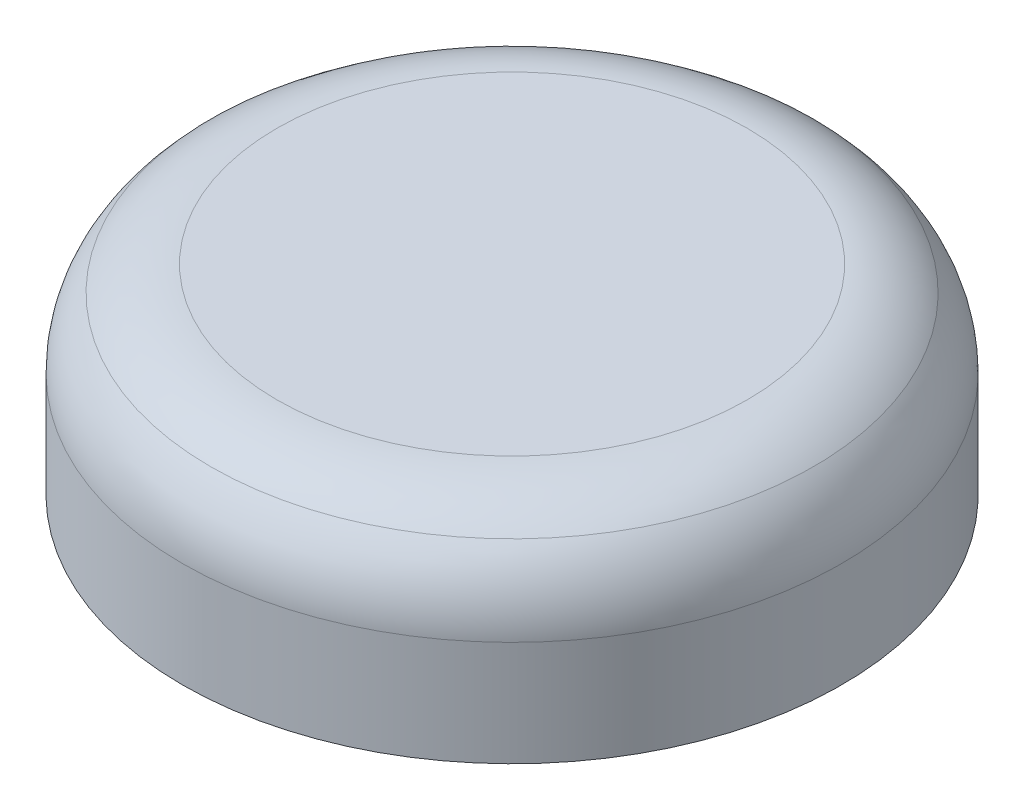
ISO-10303-21;
HEADER;
FILE_DESCRIPTION(('STEP AP214'),'2;1');
FILE_NAME('part.step','',(''),(''),'','','');
FILE_SCHEMA(('AUTOMOTIVE_DESIGN { 1 0 10303 214 1 1 1 1 }'));
ENDSEC;
DATA;
#1=APPLICATION_CONTEXT('core data for automotive mechanical design processes');
#2=APPLICATION_PROTOCOL_DEFINITION('international standard','automotive_design',2000,#1);
#3=PRODUCT_CONTEXT('',#1,'mechanical');
#4=PRODUCT('Part','Part','',(#3));
#5=PRODUCT_RELATED_PRODUCT_CATEGORY('part','',(#4));
#6=PRODUCT_DEFINITION_FORMATION('','',#4);
#7=PRODUCT_DEFINITION_CONTEXT('part definition',#1,'design');
#8=PRODUCT_DEFINITION('design','',#6,#7);
#9=PRODUCT_DEFINITION_SHAPE('','',#8);
#10=(LENGTH_UNIT() NAMED_UNIT(*) SI_UNIT(.MILLI.,.METRE.));
#11=(NAMED_UNIT(*) PLANE_ANGLE_UNIT() SI_UNIT($,.RADIAN.));
#12=(NAMED_UNIT(*) SI_UNIT($,.STERADIAN.) SOLID_ANGLE_UNIT());
#13=UNCERTAINTY_MEASURE_WITH_UNIT(LENGTH_MEASURE(1.E-05),#10,'distance_accuracy_value','');
#14=(GEOMETRIC_REPRESENTATION_CONTEXT(3) GLOBAL_UNCERTAINTY_ASSIGNED_CONTEXT((#13)) GLOBAL_UNIT_ASSIGNED_CONTEXT((#10,
#11,#12)) REPRESENTATION_CONTEXT('',''));
#15=CARTESIAN_POINT('',(0.,0.,0.));
#16=DIRECTION('',(0.,0.,1.));
#17=DIRECTION('',(1.,0.,0.));
#18=AXIS2_PLACEMENT_3D('',#15,#16,#17);
#19=CARTESIAN_POINT('',(0.,15.,0.));
#20=DIRECTION('',(0.,-1.,0.));
#21=DIRECTION('',(0.,0.,-1.));
#22=AXIS2_PLACEMENT_3D('',#19,#20,#21);
#23=CYLINDRICAL_SURFACE('',#22,30.);
#24=CARTESIAN_POINT('',(0.,15.,0.));
#25=DIRECTION('',(0.,-1.,0.));
#26=DIRECTION('',(0.,0.,-1.));
#27=AXIS2_PLACEMENT_3D('',#24,#25,#26);
#28=CIRCLE('',#27,30.);
#29=CARTESIAN_POINT('',(0.,15.,-30.));
#30=VERTEX_POINT('',#29);
#31=EDGE_CURVE('E53',#30,#30,#28,.T.);
#32=ORIENTED_EDGE('',*,*,#31,.F.);
#33=EDGE_LOOP('',(#32));
#34=FACE_BOUND('',#33,.T.);
#35=CARTESIAN_POINT('',(0.,0.,0.));
#36=DIRECTION('',(0.,1.,0.));
#37=DIRECTION('',(0.,0.,1.));
#38=AXIS2_PLACEMENT_3D('',#35,#36,#37);
#39=CIRCLE('',#38,30.);
#40=CARTESIAN_POINT('',(0.,0.,30.));
#41=VERTEX_POINT('',#40);
#42=EDGE_CURVE('E44',#41,#41,#39,.T.);
#43=ORIENTED_EDGE('',*,*,#42,.F.);
#44=EDGE_LOOP('',(#43));
#45=FACE_BOUND('',#44,.T.);
#46=ADVANCED_FACE('F33',(#34,#45),#23,.F.);
#47=CARTESIAN_POINT('',(0.,15.,0.));
#48=DIRECTION('',(0.,-1.,0.));
#49=DIRECTION('',(0.,0.,-1.));
#50=AXIS2_PLACEMENT_3D('',#47,#48,#49);
#51=CYLINDRICAL_SURFACE('',#50,33.);
#52=CARTESIAN_POINT('',(0.,10.5244027735491,0.));
#53=DIRECTION('',(0.,1.,0.));
#54=DIRECTION('',(0.,0.,1.));
#55=AXIS2_PLACEMENT_3D('',#52,#53,#54);
#56=CIRCLE('',#55,33.);
#57=CARTESIAN_POINT('',(0.,10.5244027735491,33.));
#58=VERTEX_POINT('',#57);
#59=EDGE_CURVE('E10',#58,#58,#56,.F.);
#60=ORIENTED_EDGE('',*,*,#59,.T.);
#61=EDGE_LOOP('',(#60));
#62=FACE_BOUND('',#61,.T.);
#63=CARTESIAN_POINT('',(0.,0.,0.));
#64=DIRECTION('',(0.,1.,0.));
#65=DIRECTION('',(0.,0.,1.));
#66=AXIS2_PLACEMENT_3D('',#63,#64,#65);
#67=CIRCLE('',#66,33.);
#68=CARTESIAN_POINT('',(0.,0.,33.));
#69=VERTEX_POINT('',#68);
#70=EDGE_CURVE('E40',#69,#69,#67,.T.);
#71=ORIENTED_EDGE('',*,*,#70,.T.);
#72=EDGE_LOOP('',(#71));
#73=FACE_BOUND('',#72,.T.);
#74=ADVANCED_FACE('F103',(#62,#73),#51,.T.);
#75=CARTESIAN_POINT('',(0.,0.,0.));
#76=DIRECTION('',(0.,1.,0.));
#77=DIRECTION('',(0.,0.,1.));
#78=AXIS2_PLACEMENT_3D('',#75,#76,#77);
#79=PLANE('',#78);
#80=ORIENTED_EDGE('',*,*,#42,.T.);
#81=EDGE_LOOP('',(#80));
#82=FACE_BOUND('',#81,.T.);
#83=ORIENTED_EDGE('',*,*,#70,.F.);
#84=EDGE_LOOP('',(#83));
#85=FACE_BOUND('',#84,.T.);
#86=ADVANCED_FACE('F106',(#82,#85),#79,.F.);
#87=CARTESIAN_POINT('',(0.,20.,0.));
#88=DIRECTION('',(0.,-1.,0.));
#89=DIRECTION('',(0.,0.,-1.));
#90=AXIS2_PLACEMENT_3D('',#87,#88,#89);
#91=PLANE('',#90);
#92=CARTESIAN_POINT('',(0.,20.,0.));
#93=DIRECTION('',(0.,-1.,0.));
#94=DIRECTION('',(0.,0.,-1.));
#95=AXIS2_PLACEMENT_3D('',#92,#93,#94);
#96=CIRCLE('',#95,23.5508881747693);
#97=CARTESIAN_POINT('',(0.,20.,-23.5508881747693));
#98=VERTEX_POINT('',#97);
#99=EDGE_CURVE('E59',#98,#98,#96,.T.);
#100=ORIENTED_EDGE('',*,*,#99,.F.);
#101=EDGE_LOOP('',(#100));
#102=FACE_BOUND('',#101,.T.);
#103=ADVANCED_FACE('F109',(#102),#91,.F.);
#104=CARTESIAN_POINT('',(0.,10.,0.));
#105=DIRECTION('',(0.,-1.,0.));
#106=DIRECTION('',(0.,0.,-1.));
#107=AXIS2_PLACEMENT_3D('',#104,#105,#106);
#108=TOROIDAL_SURFACE('',#107,23.5508881747693,10.);
#109=CARTESIAN_POINT('',(0.,17.5,0.));
#110=DIRECTION('',(0.,-1.,0.));
#111=DIRECTION('',(0.,0.,-1.));
#112=AXIS2_PLACEMENT_3D('',#109,#110,#111);
#113=CIRCLE('',#112,30.1652664524308);
#114=CARTESIAN_POINT('',(0.,17.5,-30.1652664524308));
#115=VERTEX_POINT('',#114);
#116=EDGE_CURVE('E56',#115,#115,#113,.T.);
#117=ORIENTED_EDGE('',*,*,#116,.F.);
#118=EDGE_LOOP('',(#117));
#119=FACE_BOUND('',#118,.T.);
#120=ORIENTED_EDGE('',*,*,#99,.T.);
#121=EDGE_LOOP('',(#120));
#122=FACE_BOUND('',#121,.T.);
#123=ADVANCED_FACE('F92',(#119,#122),#108,.T.);
#124=CARTESIAN_POINT('',(0.,7.50000000000001,0.));
#125=DIRECTION('',(0.,-1.,0.));
#126=DIRECTION('',(0.,0.,-1.));
#127=AXIS2_PLACEMENT_3D('',#124,#125,#126);
#128=TOROIDAL_SURFACE('',#127,23.227821859521,10.);
#129=CARTESIAN_POINT('',(0.,17.2384396336338,0.));
#130=DIRECTION('',(0.,-1.,0.));
#131=DIRECTION('',(0.,0.,-1.));
#132=AXIS2_PLACEMENT_3D('',#129,#130,#131);
#133=CIRCLE('',#132,25.5);
#134=CARTESIAN_POINT('',(0.,17.2384396336338,-25.5));
#135=VERTEX_POINT('',#134);
#136=EDGE_CURVE('E69',#135,#135,#133,.T.);
#137=ORIENTED_EDGE('',*,*,#136,.F.);
#138=EDGE_LOOP('',(#137));
#139=FACE_BOUND('',#138,.T.);
#140=CARTESIAN_POINT('',(0.,15.808760260363,0.));
#141=DIRECTION('',(0.,-1.,0.));
#142=DIRECTION('',(0.,0.,-1.));
#143=AXIS2_PLACEMENT_3D('',#140,#141,#142);
#144=CIRCLE('',#143,28.7923975788201);
#145=CARTESIAN_POINT('',(0.,15.808760260363,-28.7923975788201));
#146=VERTEX_POINT('',#145);
#147=EDGE_CURVE('E48',#146,#146,#144,.T.);
#148=ORIENTED_EDGE('',*,*,#147,.T.);
#149=EDGE_LOOP('',(#148));
#150=FACE_BOUND('',#149,.T.);
#151=ADVANCED_FACE('F88',(#139,#150),#128,.F.);
#152=CARTESIAN_POINT('',(0.,15.,0.));
#153=DIRECTION('',(0.,-1.,0.));
#154=DIRECTION('',(0.,0.,-1.));
#155=AXIS2_PLACEMENT_3D('',#152,#153,#154);
#156=CONICAL_SURFACE('',#155,30.,0.980680129844024);
#157=ORIENTED_EDGE('',*,*,#147,.F.);
#158=EDGE_LOOP('',(#157));
#159=FACE_BOUND('',#158,.T.);
#160=ORIENTED_EDGE('',*,*,#31,.T.);
#161=EDGE_LOOP('',(#160));
#162=FACE_BOUND('',#161,.T.);
#163=ADVANCED_FACE('F91',(#159,#162),#156,.F.);
#164=CARTESIAN_POINT('',(0.,7.50000000000001,0.));
#165=DIRECTION('',(0.,-1.,0.));
#166=DIRECTION('',(0.,0.,-1.));
#167=AXIS2_PLACEMENT_3D('',#164,#165,#166);
#168=TOROIDAL_SURFACE('',#167,23.227821859521,10.);
#169=CARTESIAN_POINT('',(0.,17.4770014296258,0.));
#170=DIRECTION('',(0.,-1.,0.));
#171=DIRECTION('',(0.,0.,-1.));
#172=AXIS2_PLACEMENT_3D('',#169,#170,#171);
#173=CIRCLE('',#172,22.55);
#174=CARTESIAN_POINT('',(0.,17.4770014296258,-22.55));
#175=VERTEX_POINT('',#174);
#176=EDGE_CURVE('E65',#175,#175,#173,.T.);
#177=ORIENTED_EDGE('',*,*,#176,.T.);
#178=EDGE_LOOP('',(#177));
#179=FACE_BOUND('',#178,.T.);
#180=CARTESIAN_POINT('',(0.,17.5,0.));
#181=DIRECTION('',(0.,-1.,0.));
#182=DIRECTION('',(0.,0.,-1.));
#183=AXIS2_PLACEMENT_3D('',#180,#181,#182);
#184=CIRCLE('',#183,23.227821859521);
#185=CARTESIAN_POINT('',(0.,17.5,-23.227821859521));
#186=VERTEX_POINT('',#185);
#187=EDGE_CURVE('E62',#186,#186,#184,.T.);
#188=ORIENTED_EDGE('',*,*,#187,.F.);
#189=EDGE_LOOP('',(#188));
#190=FACE_BOUND('',#189,.T.);
#191=ADVANCED_FACE('F84',(#179,#190),#168,.T.);
#192=CARTESIAN_POINT('',(0.,36.0624458405139,0.));
#193=DIRECTION('',(0.,-1.,0.));
#194=DIRECTION('',(0.,0.,-1.));
#195=AXIS2_PLACEMENT_3D('',#192,#193,#194);
#196=CYLINDRICAL_SURFACE('',#195,25.5);
#197=CARTESIAN_POINT('',(0.,0.,0.));
#198=DIRECTION('',(0.,-1.,0.));
#199=DIRECTION('',(0.,0.,-1.));
#200=AXIS2_PLACEMENT_3D('',#197,#198,#199);
#201=CIRCLE('',#200,25.5);
#202=CARTESIAN_POINT('',(0.,0.,-25.5));
#203=VERTEX_POINT('',#202);
#204=EDGE_CURVE('E68',#203,#203,#201,.T.);
#205=ORIENTED_EDGE('',*,*,#204,.F.);
#206=EDGE_LOOP('',(#205));
#207=FACE_BOUND('',#206,.T.);
#208=ORIENTED_EDGE('',*,*,#136,.T.);
#209=EDGE_LOOP('',(#208));
#210=FACE_BOUND('',#209,.T.);
#211=ADVANCED_FACE('F80',(#207,#210),#196,.T.);
#212=CARTESIAN_POINT('',(0.,36.0624458405139,0.));
#213=DIRECTION('',(0.,-1.,0.));
#214=DIRECTION('',(0.,0.,-1.));
#215=AXIS2_PLACEMENT_3D('',#212,#213,#214);
#216=CYLINDRICAL_SURFACE('',#215,22.55);
#217=CARTESIAN_POINT('',(0.,0.,0.));
#218=DIRECTION('',(0.,-1.,0.));
#219=DIRECTION('',(0.,0.,-1.));
#220=AXIS2_PLACEMENT_3D('',#217,#218,#219);
#221=CIRCLE('',#220,22.55);
#222=CARTESIAN_POINT('',(0.,0.,-22.55));
#223=VERTEX_POINT('',#222);
#224=EDGE_CURVE('E72',#223,#223,#221,.T.);
#225=ORIENTED_EDGE('',*,*,#224,.T.);
#226=EDGE_LOOP('',(#225));
#227=FACE_BOUND('',#226,.T.);
#228=ORIENTED_EDGE('',*,*,#176,.F.);
#229=EDGE_LOOP('',(#228));
#230=FACE_BOUND('',#229,.T.);
#231=ADVANCED_FACE('F83',(#227,#230),#216,.F.);
#232=CARTESIAN_POINT('',(0.,0.,0.));
#233=DIRECTION('',(0.,-1.,0.));
#234=DIRECTION('',(0.,0.,-1.));
#235=AXIS2_PLACEMENT_3D('',#232,#233,#234);
#236=PLANE('',#235);
#237=ORIENTED_EDGE('',*,*,#224,.F.);
#238=EDGE_LOOP('',(#237));
#239=FACE_BOUND('',#238,.T.);
#240=ORIENTED_EDGE('',*,*,#204,.T.);
#241=EDGE_LOOP('',(#240));
#242=FACE_BOUND('',#241,.T.);
#243=ADVANCED_FACE('F78',(#239,#242),#236,.T.);
#244=CARTESIAN_POINT('',(-23.227821859521,17.5,0.));
#245=DIRECTION('',(0.,1.,0.));
#246=DIRECTION('',(0.,0.,1.));
#247=AXIS2_PLACEMENT_3D('',#244,#245,#246);
#248=PLANE('',#247);
#249=ORIENTED_EDGE('',*,*,#187,.T.);
#250=EDGE_LOOP('',(#249));
#251=FACE_BOUND('',#250,.T.);
#252=ADVANCED_FACE('F119',(#251),#248,.F.);
#253=CARTESIAN_POINT('',(0.,10.5244027735491,0.));
#254=DIRECTION('',(0.,1.,0.));
#255=DIRECTION('',(0.,0.,1.));
#256=AXIS2_PLACEMENT_3D('',#253,#254,#255);
#257=TOROIDAL_SURFACE('',#256,23.,10.);
#258=ORIENTED_EDGE('',*,*,#59,.F.);
#259=EDGE_LOOP('',(#258));
#260=FACE_BOUND('',#259,.T.);
#261=ORIENTED_EDGE('',*,*,#116,.T.);
#262=EDGE_LOOP('',(#261));
#263=FACE_BOUND('',#262,.T.);
#264=ADVANCED_FACE('F35',(#260,#263),#257,.T.);
#265=CLOSED_SHELL('',(#46,#74,#86,#103,#123,#151,#163,#191,#211,#231,#243,#252,#264));
#266=MANIFOLD_SOLID_BREP('B2',#265);
#267=ADVANCED_BREP_SHAPE_REPRESENTATION('',(#18,#266),#14);
#268=SHAPE_DEFINITION_REPRESENTATION(#9,#267);
ENDSEC;
END-ISO-10303-21;
